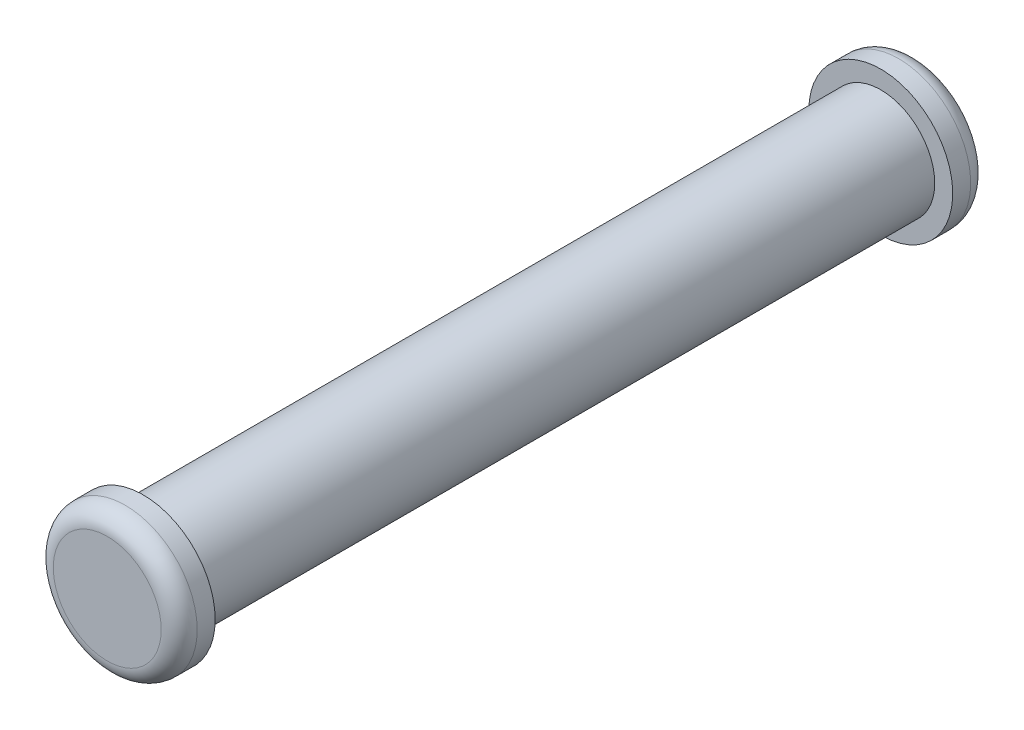
ISO-10303-21;
HEADER;
FILE_DESCRIPTION(('STEP AP214'),'2;1');
FILE_NAME('part.step','',(''),(''),'','','');
FILE_SCHEMA(('AUTOMOTIVE_DESIGN { 1 0 10303 214 1 1 1 1 }'));
ENDSEC;
DATA;
#1=APPLICATION_CONTEXT('core data for automotive mechanical design processes');
#2=APPLICATION_PROTOCOL_DEFINITION('international standard','automotive_design',2000,#1);
#3=PRODUCT_CONTEXT('',#1,'mechanical');
#4=PRODUCT('Part','Part','',(#3));
#5=PRODUCT_RELATED_PRODUCT_CATEGORY('part','',(#4));
#6=PRODUCT_DEFINITION_FORMATION('','',#4);
#7=PRODUCT_DEFINITION_CONTEXT('part definition',#1,'design');
#8=PRODUCT_DEFINITION('design','',#6,#7);
#9=PRODUCT_DEFINITION_SHAPE('','',#8);
#10=(LENGTH_UNIT() NAMED_UNIT(*) SI_UNIT(.MILLI.,.METRE.));
#11=(NAMED_UNIT(*) PLANE_ANGLE_UNIT() SI_UNIT($,.RADIAN.));
#12=(NAMED_UNIT(*) SI_UNIT($,.STERADIAN.) SOLID_ANGLE_UNIT());
#13=UNCERTAINTY_MEASURE_WITH_UNIT(LENGTH_MEASURE(1.E-05),#10,'distance_accuracy_value','');
#14=(GEOMETRIC_REPRESENTATION_CONTEXT(3) GLOBAL_UNCERTAINTY_ASSIGNED_CONTEXT((#13)) GLOBAL_UNIT_ASSIGNED_CONTEXT((#10,
#11,#12)) REPRESENTATION_CONTEXT('',''));
#15=CARTESIAN_POINT('',(0.,0.,0.));
#16=DIRECTION('',(0.,0.,1.));
#17=DIRECTION('',(1.,0.,0.));
#18=AXIS2_PLACEMENT_3D('',#15,#16,#17);
#19=CARTESIAN_POINT('',(0.,0.,20.5));
#20=DIRECTION('',(0.,0.,-1.));
#21=DIRECTION('',(-1.,0.,0.));
#22=AXIS2_PLACEMENT_3D('',#19,#20,#21);
#23=CYLINDRICAL_SURFACE('',#22,1.5);
#24=CARTESIAN_POINT('',(0.,0.,20.5));
#25=DIRECTION('',(0.,0.,1.));
#26=DIRECTION('',(1.,0.,0.));
#27=AXIS2_PLACEMENT_3D('',#24,#25,#26);
#28=CIRCLE('',#27,1.5);
#29=CARTESIAN_POINT('',(1.5,0.,20.5));
#30=VERTEX_POINT('',#29);
#31=EDGE_CURVE('E59',#30,#30,#28,.T.);
#32=ORIENTED_EDGE('',*,*,#31,.F.);
#33=EDGE_LOOP('',(#32));
#34=FACE_BOUND('',#33,.T.);
#35=CARTESIAN_POINT('',(0.,0.,0.));
#36=DIRECTION('',(0.,0.,1.));
#37=DIRECTION('',(1.,0.,0.));
#38=AXIS2_PLACEMENT_3D('',#35,#36,#37);
#39=CIRCLE('',#38,1.5);
#40=CARTESIAN_POINT('',(1.5,0.,0.));
#41=VERTEX_POINT('',#40);
#42=EDGE_CURVE('E60',#41,#41,#39,.T.);
#43=ORIENTED_EDGE('',*,*,#42,.T.);
#44=EDGE_LOOP('',(#43));
#45=FACE_BOUND('',#44,.T.);
#46=ADVANCED_FACE('F39',(#34,#45),#23,.T.);
#47=CARTESIAN_POINT('',(0.,0.,-1.));
#48=DIRECTION('',(0.,0.,1.));
#49=DIRECTION('',(1.,0.,0.));
#50=AXIS2_PLACEMENT_3D('',#47,#48,#49);
#51=CYLINDRICAL_SURFACE('',#50,2.);
#52=CARTESIAN_POINT('',(0.,0.,-0.5));
#53=DIRECTION('',(0.,0.,-1.));
#54=DIRECTION('',(-1.,0.,0.));
#55=AXIS2_PLACEMENT_3D('',#52,#53,#54);
#56=CIRCLE('',#55,2.);
#57=CARTESIAN_POINT('',(-2.,0.,-0.5));
#58=VERTEX_POINT('',#57);
#59=EDGE_CURVE('E50',#58,#58,#56,.F.);
#60=ORIENTED_EDGE('',*,*,#59,.T.);
#61=EDGE_LOOP('',(#60));
#62=FACE_BOUND('',#61,.T.);
#63=CARTESIAN_POINT('',(0.,0.,0.));
#64=DIRECTION('',(0.,0.,-1.));
#65=DIRECTION('',(-1.,0.,0.));
#66=AXIS2_PLACEMENT_3D('',#63,#64,#65);
#67=CIRCLE('',#66,2.);
#68=CARTESIAN_POINT('',(-2.,0.,0.));
#69=VERTEX_POINT('',#68);
#70=EDGE_CURVE('E63',#69,#69,#67,.T.);
#71=ORIENTED_EDGE('',*,*,#70,.T.);
#72=EDGE_LOOP('',(#71));
#73=FACE_BOUND('',#72,.T.);
#74=ADVANCED_FACE('F90',(#62,#73),#51,.T.);
#75=CARTESIAN_POINT('',(0.,0.,-1.));
#76=DIRECTION('',(0.,0.,-1.));
#77=DIRECTION('',(-1.,0.,0.));
#78=AXIS2_PLACEMENT_3D('',#75,#76,#77);
#79=PLANE('',#78);
#80=CARTESIAN_POINT('',(0.,0.,-1.));
#81=DIRECTION('',(0.,0.,-1.));
#82=DIRECTION('',(-1.,0.,0.));
#83=AXIS2_PLACEMENT_3D('',#80,#81,#82);
#84=CIRCLE('',#83,1.5);
#85=CARTESIAN_POINT('',(-1.5,0.,-1.));
#86=VERTEX_POINT('',#85);
#87=EDGE_CURVE('E54',#86,#86,#84,.T.);
#88=ORIENTED_EDGE('',*,*,#87,.T.);
#89=EDGE_LOOP('',(#88));
#90=FACE_BOUND('',#89,.T.);
#91=ADVANCED_FACE('F95',(#90),#79,.T.);
#92=CARTESIAN_POINT('',(0.,0.,0.));
#93=DIRECTION('',(0.,0.,-1.));
#94=DIRECTION('',(-1.,0.,0.));
#95=AXIS2_PLACEMENT_3D('',#92,#93,#94);
#96=PLANE('',#95);
#97=ORIENTED_EDGE('',*,*,#42,.F.);
#98=EDGE_LOOP('',(#97));
#99=FACE_BOUND('',#98,.T.);
#100=ORIENTED_EDGE('',*,*,#70,.F.);
#101=EDGE_LOOP('',(#100));
#102=FACE_BOUND('',#101,.T.);
#103=ADVANCED_FACE('F101',(#99,#102),#96,.F.);
#104=CARTESIAN_POINT('',(0.,0.,21.5));
#105=DIRECTION('',(0.,0.,-1.));
#106=DIRECTION('',(-1.,0.,0.));
#107=AXIS2_PLACEMENT_3D('',#104,#105,#106);
#108=CYLINDRICAL_SURFACE('',#107,2.);
#109=CARTESIAN_POINT('',(0.,0.,21.));
#110=DIRECTION('',(0.,0.,1.));
#111=DIRECTION('',(1.,0.,0.));
#112=AXIS2_PLACEMENT_3D('',#109,#110,#111);
#113=CIRCLE('',#112,2.);
#114=CARTESIAN_POINT('',(2.,0.,21.));
#115=VERTEX_POINT('',#114);
#116=EDGE_CURVE('E10',#115,#115,#113,.F.);
#117=ORIENTED_EDGE('',*,*,#116,.T.);
#118=EDGE_LOOP('',(#117));
#119=FACE_BOUND('',#118,.T.);
#120=CARTESIAN_POINT('',(0.,0.,20.5));
#121=DIRECTION('',(0.,0.,1.));
#122=DIRECTION('',(1.,0.,0.));
#123=AXIS2_PLACEMENT_3D('',#120,#121,#122);
#124=CIRCLE('',#123,2.);
#125=CARTESIAN_POINT('',(2.,0.,20.5));
#126=VERTEX_POINT('',#125);
#127=EDGE_CURVE('E68',#126,#126,#124,.T.);
#128=ORIENTED_EDGE('',*,*,#127,.T.);
#129=EDGE_LOOP('',(#128));
#130=FACE_BOUND('',#129,.T.);
#131=ADVANCED_FACE('F72',(#119,#130),#108,.T.);
#132=CARTESIAN_POINT('',(0.,0.,21.5));
#133=DIRECTION('',(0.,0.,1.));
#134=DIRECTION('',(1.,0.,0.));
#135=AXIS2_PLACEMENT_3D('',#132,#133,#134);
#136=PLANE('',#135);
#137=CARTESIAN_POINT('',(0.,0.,21.5));
#138=DIRECTION('',(0.,0.,1.));
#139=DIRECTION('',(1.,0.,0.));
#140=AXIS2_PLACEMENT_3D('',#137,#138,#139);
#141=CIRCLE('',#140,1.5);
#142=CARTESIAN_POINT('',(1.5,0.,21.5));
#143=VERTEX_POINT('',#142);
#144=EDGE_CURVE('E46',#143,#143,#141,.T.);
#145=ORIENTED_EDGE('',*,*,#144,.T.);
#146=EDGE_LOOP('',(#145));
#147=FACE_BOUND('',#146,.T.);
#148=ADVANCED_FACE('F77',(#147),#136,.T.);
#149=CARTESIAN_POINT('',(0.,0.,20.5));
#150=DIRECTION('',(0.,0.,1.));
#151=DIRECTION('',(1.,0.,0.));
#152=AXIS2_PLACEMENT_3D('',#149,#150,#151);
#153=PLANE('',#152);
#154=ORIENTED_EDGE('',*,*,#31,.T.);
#155=EDGE_LOOP('',(#154));
#156=FACE_BOUND('',#155,.T.);
#157=ORIENTED_EDGE('',*,*,#127,.F.);
#158=EDGE_LOOP('',(#157));
#159=FACE_BOUND('',#158,.T.);
#160=ADVANCED_FACE('F74',(#156,#159),#153,.F.);
#161=CARTESIAN_POINT('',(0.,0.,-0.5));
#162=DIRECTION('',(0.,0.,-1.));
#163=DIRECTION('',(-1.,0.,0.));
#164=AXIS2_PLACEMENT_3D('',#161,#162,#163);
#165=TOROIDAL_SURFACE('',#164,1.5,0.5);
#166=ORIENTED_EDGE('',*,*,#59,.F.);
#167=EDGE_LOOP('',(#166));
#168=FACE_BOUND('',#167,.T.);
#169=ORIENTED_EDGE('',*,*,#87,.F.);
#170=EDGE_LOOP('',(#169));
#171=FACE_BOUND('',#170,.T.);
#172=ADVANCED_FACE('F76',(#168,#171),#165,.T.);
#173=CARTESIAN_POINT('',(0.,0.,21.));
#174=DIRECTION('',(0.,0.,1.));
#175=DIRECTION('',(1.,0.,0.));
#176=AXIS2_PLACEMENT_3D('',#173,#174,#175);
#177=TOROIDAL_SURFACE('',#176,1.5,0.5);
#178=ORIENTED_EDGE('',*,*,#116,.F.);
#179=EDGE_LOOP('',(#178));
#180=FACE_BOUND('',#179,.T.);
#181=ORIENTED_EDGE('',*,*,#144,.F.);
#182=EDGE_LOOP('',(#181));
#183=FACE_BOUND('',#182,.T.);
#184=ADVANCED_FACE('F41',(#180,#183),#177,.T.);
#185=CLOSED_SHELL('',(#46,#74,#91,#103,#131,#148,#160,#172,#184));
#186=MANIFOLD_SOLID_BREP('B2',#185);
#187=ADVANCED_BREP_SHAPE_REPRESENTATION('',(#18,#186),#14);
#188=SHAPE_DEFINITION_REPRESENTATION(#9,#187);
ENDSEC;
END-ISO-10303-21;
